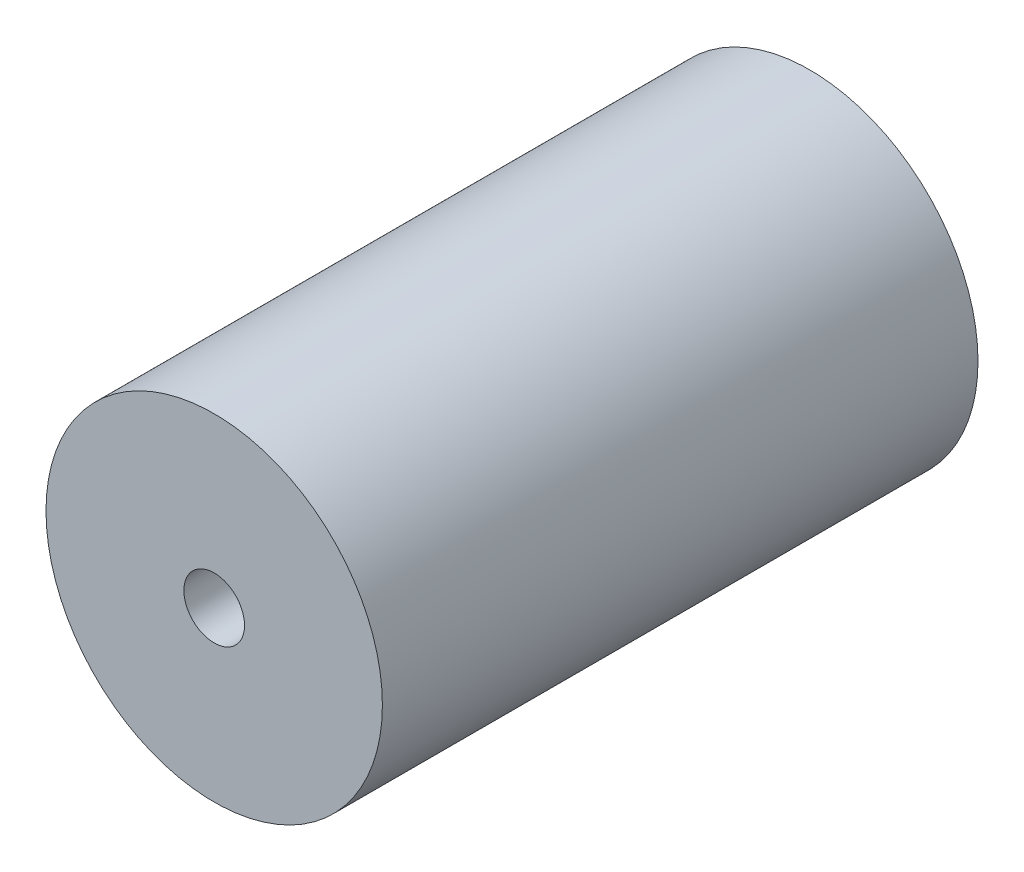
ISO-10303-21;
HEADER;
FILE_DESCRIPTION(('STEP AP214'),'2;1');
FILE_NAME('part.step','',(''),(''),'','','');
FILE_SCHEMA(('AUTOMOTIVE_DESIGN { 1 0 10303 214 1 1 1 1 }'));
ENDSEC;
DATA;
#1=APPLICATION_CONTEXT('core data for automotive mechanical design processes');
#2=APPLICATION_PROTOCOL_DEFINITION('international standard','automotive_design',2000,#1);
#3=PRODUCT_CONTEXT('',#1,'mechanical');
#4=PRODUCT('Part','Part','',(#3));
#5=PRODUCT_RELATED_PRODUCT_CATEGORY('part','',(#4));
#6=PRODUCT_DEFINITION_FORMATION('','',#4);
#7=PRODUCT_DEFINITION_CONTEXT('part definition',#1,'design');
#8=PRODUCT_DEFINITION('design','',#6,#7);
#9=PRODUCT_DEFINITION_SHAPE('','',#8);
#10=(LENGTH_UNIT() NAMED_UNIT(*) SI_UNIT(.MILLI.,.METRE.));
#11=(NAMED_UNIT(*) PLANE_ANGLE_UNIT() SI_UNIT($,.RADIAN.));
#12=(NAMED_UNIT(*) SI_UNIT($,.STERADIAN.) SOLID_ANGLE_UNIT());
#13=UNCERTAINTY_MEASURE_WITH_UNIT(LENGTH_MEASURE(1.E-05),#10,'distance_accuracy_value','');
#14=(GEOMETRIC_REPRESENTATION_CONTEXT(3) GLOBAL_UNCERTAINTY_ASSIGNED_CONTEXT((#13)) GLOBAL_UNIT_ASSIGNED_CONTEXT((#10,
#11,#12)) REPRESENTATION_CONTEXT('',''));
#15=CARTESIAN_POINT('',(0.,0.,0.));
#16=DIRECTION('',(0.,0.,1.));
#17=DIRECTION('',(1.,0.,0.));
#18=AXIS2_PLACEMENT_3D('',#15,#16,#17);
#19=CARTESIAN_POINT('',(0.,0.,108.));
#20=DIRECTION('',(0.,0.,-1.));
#21=DIRECTION('',(-1.,0.,0.));
#22=AXIS2_PLACEMENT_3D('',#19,#20,#21);
#23=CYLINDRICAL_SURFACE('',#22,30.5);
#24=CARTESIAN_POINT('',(0.,0.,108.));
#25=DIRECTION('',(0.,0.,1.));
#26=DIRECTION('',(1.,0.,0.));
#27=AXIS2_PLACEMENT_3D('',#24,#25,#26);
#28=CIRCLE('',#27,30.5);
#29=CARTESIAN_POINT('',(30.5,0.,108.));
#30=VERTEX_POINT('',#29);
#31=EDGE_CURVE('E10',#30,#30,#28,.T.);
#32=ORIENTED_EDGE('',*,*,#31,.F.);
#33=EDGE_LOOP('',(#32));
#34=FACE_BOUND('',#33,.T.);
#35=CARTESIAN_POINT('',(0.,0.,0.));
#36=DIRECTION('',(0.,0.,1.));
#37=DIRECTION('',(1.,0.,0.));
#38=AXIS2_PLACEMENT_3D('',#35,#36,#37);
#39=CIRCLE('',#38,30.5);
#40=CARTESIAN_POINT('',(30.5,0.,0.));
#41=VERTEX_POINT('',#40);
#42=EDGE_CURVE('E40',#41,#41,#39,.T.);
#43=ORIENTED_EDGE('',*,*,#42,.T.);
#44=EDGE_LOOP('',(#43));
#45=FACE_BOUND('',#44,.T.);
#46=ADVANCED_FACE('F37',(#34,#45),#23,.T.);
#47=CARTESIAN_POINT('',(0.,0.,108.));
#48=DIRECTION('',(0.,0.,1.));
#49=DIRECTION('',(1.,0.,0.));
#50=AXIS2_PLACEMENT_3D('',#47,#48,#49);
#51=PLANE('',#50);
#52=CARTESIAN_POINT('',(0.,0.,108.));
#53=DIRECTION('',(0.,0.,1.));
#54=DIRECTION('',(1.,0.,0.));
#55=AXIS2_PLACEMENT_3D('',#52,#53,#54);
#56=CIRCLE('',#55,5.5);
#57=CARTESIAN_POINT('',(5.5,0.,108.));
#58=VERTEX_POINT('',#57);
#59=EDGE_CURVE('E49',#58,#58,#56,.F.);
#60=ORIENTED_EDGE('',*,*,#59,.T.);
#61=EDGE_LOOP('',(#60));
#62=FACE_BOUND('',#61,.T.);
#63=ORIENTED_EDGE('',*,*,#31,.T.);
#64=EDGE_LOOP('',(#63));
#65=FACE_BOUND('',#64,.T.);
#66=ADVANCED_FACE('F69',(#62,#65),#51,.T.);
#67=CARTESIAN_POINT('',(0.,0.,0.));
#68=DIRECTION('',(0.,0.,1.));
#69=DIRECTION('',(1.,0.,0.));
#70=AXIS2_PLACEMENT_3D('',#67,#68,#69);
#71=PLANE('',#70);
#72=CARTESIAN_POINT('',(0.,0.,0.));
#73=DIRECTION('',(0.,0.,1.));
#74=DIRECTION('',(1.,0.,0.));
#75=AXIS2_PLACEMENT_3D('',#72,#73,#74);
#76=CIRCLE('',#75,5.5);
#77=CARTESIAN_POINT('',(5.5,0.,0.));
#78=VERTEX_POINT('',#77);
#79=EDGE_CURVE('E54',#78,#78,#76,.T.);
#80=ORIENTED_EDGE('',*,*,#79,.T.);
#81=EDGE_LOOP('',(#80));
#82=FACE_BOUND('',#81,.T.);
#83=ORIENTED_EDGE('',*,*,#42,.F.);
#84=EDGE_LOOP('',(#83));
#85=FACE_BOUND('',#84,.T.);
#86=ADVANCED_FACE('F59',(#82,#85),#71,.F.);
#87=CARTESIAN_POINT('',(0.,0.,110.));
#88=DIRECTION('',(0.,0.,-1.));
#89=DIRECTION('',(-1.,0.,0.));
#90=AXIS2_PLACEMENT_3D('',#87,#88,#89);
#91=CYLINDRICAL_SURFACE('',#90,5.5);
#92=ORIENTED_EDGE('',*,*,#59,.F.);
#93=EDGE_LOOP('',(#92));
#94=FACE_BOUND('',#93,.T.);
#95=ORIENTED_EDGE('',*,*,#79,.F.);
#96=EDGE_LOOP('',(#95));
#97=FACE_BOUND('',#96,.T.);
#98=ADVANCED_FACE('F62',(#94,#97),#91,.F.);
#99=CLOSED_SHELL('',(#46,#66,#86,#98));
#100=MANIFOLD_SOLID_BREP('B2',#99);
#101=ADVANCED_BREP_SHAPE_REPRESENTATION('',(#18,#100),#14);
#102=SHAPE_DEFINITION_REPRESENTATION(#9,#101);
ENDSEC;
END-ISO-10303-21;
